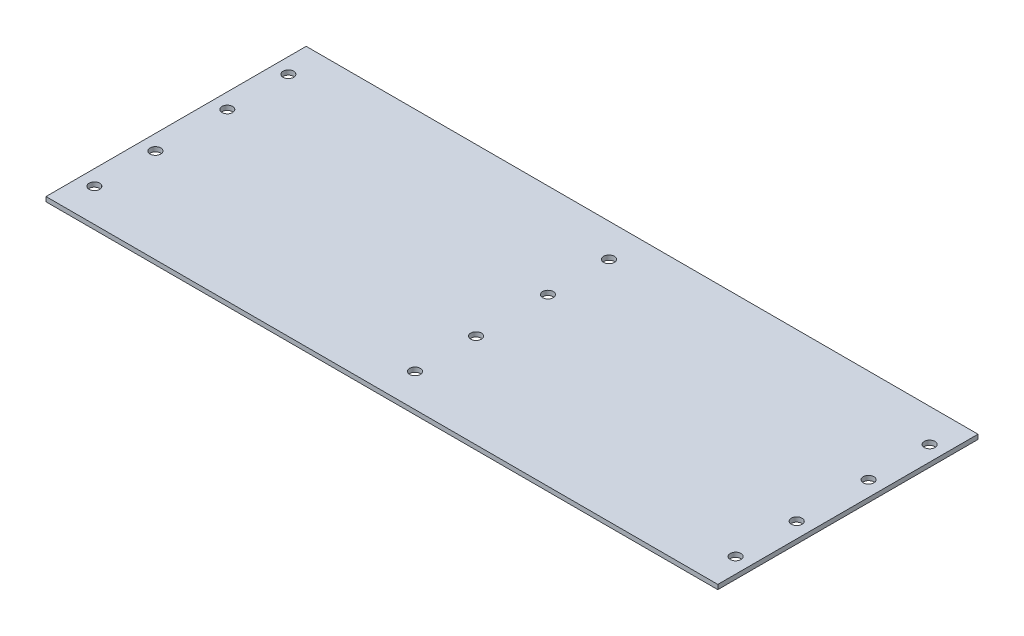
ISO-10303-21;
HEADER;
FILE_DESCRIPTION(('STEP AP214'),'2;1');
FILE_NAME('part.step','',(''),(''),'','','');
FILE_SCHEMA(('AUTOMOTIVE_DESIGN { 1 0 10303 214 1 1 1 1 }'));
ENDSEC;
DATA;
#1=APPLICATION_CONTEXT('core data for automotive mechanical design processes');
#2=APPLICATION_PROTOCOL_DEFINITION('international standard','automotive_design',2000,#1);
#3=PRODUCT_CONTEXT('',#1,'mechanical');
#4=PRODUCT('Part','Part','',(#3));
#5=PRODUCT_RELATED_PRODUCT_CATEGORY('part','',(#4));
#6=PRODUCT_DEFINITION_FORMATION('','',#4);
#7=PRODUCT_DEFINITION_CONTEXT('part definition',#1,'design');
#8=PRODUCT_DEFINITION('design','',#6,#7);
#9=PRODUCT_DEFINITION_SHAPE('','',#8);
#10=(LENGTH_UNIT() NAMED_UNIT(*) SI_UNIT(.MILLI.,.METRE.));
#11=(NAMED_UNIT(*) PLANE_ANGLE_UNIT() SI_UNIT($,.RADIAN.));
#12=(NAMED_UNIT(*) SI_UNIT($,.STERADIAN.) SOLID_ANGLE_UNIT());
#13=UNCERTAINTY_MEASURE_WITH_UNIT(LENGTH_MEASURE(1.E-05),#10,'distance_accuracy_value','');
#14=(GEOMETRIC_REPRESENTATION_CONTEXT(3) GLOBAL_UNCERTAINTY_ASSIGNED_CONTEXT((#13)) GLOBAL_UNIT_ASSIGNED_CONTEXT((#10,
#11,#12)) REPRESENTATION_CONTEXT('',''));
#15=CARTESIAN_POINT('',(0.,0.,0.));
#16=DIRECTION('',(0.,0.,1.));
#17=DIRECTION('',(1.,0.,0.));
#18=AXIS2_PLACEMENT_3D('',#15,#16,#17);
#19=CARTESIAN_POINT('',(0.,1.5,0.));
#20=DIRECTION('',(0.,1.,0.));
#21=DIRECTION('',(0.,0.,1.));
#22=AXIS2_PLACEMENT_3D('',#19,#20,#21);
#23=PLANE('',#22);
#24=CARTESIAN_POINT('',(149.295012832051,1.5,-13.4872525947132));
#25=DIRECTION('',(0.,1.,0.));
#26=DIRECTION('',(0.,0.,1.));
#27=AXIS2_PLACEMENT_3D('',#24,#25,#26);
#28=CIRCLE('',#27,1.74999999999922);
#29=CARTESIAN_POINT('',(149.295012832051,1.5,-11.737252594714));
#30=VERTEX_POINT('',#29);
#31=EDGE_CURVE('E342',#30,#30,#28,.F.);
#32=ORIENTED_EDGE('',*,*,#31,.T.);
#33=EDGE_LOOP('',(#32));
#34=FACE_BOUND('',#33,.T.);
#35=CARTESIAN_POINT('',(-60.704987167949,1.5,-33.4872525947146));
#36=DIRECTION('',(0.,1.,0.));
#37=DIRECTION('',(0.,0.,1.));
#38=AXIS2_PLACEMENT_3D('',#35,#36,#37);
#39=CIRCLE('',#38,1.74999999999922);
#40=CARTESIAN_POINT('',(-60.704987167949,1.5,-31.7372525947154));
#41=VERTEX_POINT('',#40);
#42=EDGE_CURVE('E353',#41,#41,#39,.F.);
#43=ORIENTED_EDGE('',*,*,#42,.T.);
#44=EDGE_LOOP('',(#43));
#45=FACE_BOUND('',#44,.T.);
#46=CARTESIAN_POINT('',(149.295012832051,1.5,10.0527474052838));
#47=DIRECTION('',(0.,1.,0.));
#48=DIRECTION('',(0.,0.,1.));
#49=AXIS2_PLACEMENT_3D('',#46,#47,#48);
#50=CIRCLE('',#49,1.75000000000001);
#51=CARTESIAN_POINT('',(149.295012832051,1.5,11.8027474052838));
#52=VERTEX_POINT('',#51);
#53=EDGE_CURVE('E360',#52,#52,#50,.T.);
#54=ORIENTED_EDGE('',*,*,#53,.F.);
#55=EDGE_LOOP('',(#54));
#56=FACE_BOUND('',#55,.T.);
#57=CARTESIAN_POINT('',(44.295012832051,1.5,10.0527474052845));
#58=DIRECTION('',(0.,1.,0.));
#59=DIRECTION('',(0.,0.,1.));
#60=AXIS2_PLACEMENT_3D('',#57,#58,#59);
#61=CIRCLE('',#60,1.75000000000001);
#62=CARTESIAN_POINT('',(44.295012832051,1.5,11.8027474052845));
#63=VERTEX_POINT('',#62);
#64=EDGE_CURVE('E358',#63,#63,#61,.T.);
#65=ORIENTED_EDGE('',*,*,#64,.F.);
#66=EDGE_LOOP('',(#65));
#67=FACE_BOUND('',#66,.T.);
#68=CARTESIAN_POINT('',(44.2950128320511,1.5,30.0527474052845));
#69=DIRECTION('',(0.,1.,0.));
#70=DIRECTION('',(0.,0.,1.));
#71=AXIS2_PLACEMENT_3D('',#68,#69,#70);
#72=CIRCLE('',#71,1.75000000000001);
#73=CARTESIAN_POINT('',(44.2950128320511,1.5,31.8027474052845));
#74=VERTEX_POINT('',#73);
#75=EDGE_CURVE('E347',#74,#74,#72,.T.);
#76=ORIENTED_EDGE('',*,*,#75,.F.);
#77=EDGE_LOOP('',(#76));
#78=FACE_BOUND('',#77,.T.);
#79=CARTESIAN_POINT('',(-60.7049871679491,1.5,-13.4872525947146));
#80=DIRECTION('',(0.,1.,0.));
#81=DIRECTION('',(0.,0.,1.));
#82=AXIS2_PLACEMENT_3D('',#79,#80,#81);
#83=CIRCLE('',#82,1.74999999999922);
#84=CARTESIAN_POINT('',(-60.7049871679491,1.5,-11.7372525947154));
#85=VERTEX_POINT('',#84);
#86=EDGE_CURVE('E399',#85,#85,#83,.F.);
#87=ORIENTED_EDGE('',*,*,#86,.T.);
#88=EDGE_LOOP('',(#87));
#89=FACE_BOUND('',#88,.T.);
#90=CARTESIAN_POINT('',(-60.7049871679489,1.5,10.0527474052852));
#91=DIRECTION('',(0.,1.,0.));
#92=DIRECTION('',(0.,0.,1.));
#93=AXIS2_PLACEMENT_3D('',#90,#91,#92);
#94=CIRCLE('',#93,1.75000000000001);
#95=CARTESIAN_POINT('',(-60.7049871679489,1.5,11.8027474052852));
#96=VERTEX_POINT('',#95);
#97=EDGE_CURVE('E403',#96,#96,#94,.T.);
#98=ORIENTED_EDGE('',*,*,#97,.F.);
#99=EDGE_LOOP('',(#98));
#100=FACE_BOUND('',#99,.T.);
#101=CARTESIAN_POINT('',(-60.7049871679489,1.5,30.0527474052852));
#102=DIRECTION('',(0.,1.,0.));
#103=DIRECTION('',(0.,0.,1.));
#104=AXIS2_PLACEMENT_3D('',#101,#102,#103);
#105=CIRCLE('',#104,1.75000000000001);
#106=CARTESIAN_POINT('',(-60.7049871679489,1.5,31.8027474052852));
#107=VERTEX_POINT('',#106);
#108=EDGE_CURVE('E406',#107,#107,#105,.T.);
#109=ORIENTED_EDGE('',*,*,#108,.F.);
#110=EDGE_LOOP('',(#109));
#111=FACE_BOUND('',#110,.T.);
#112=CARTESIAN_POINT('',(149.295012832051,1.5,30.0527474052838));
#113=DIRECTION('',(0.,1.,0.));
#114=DIRECTION('',(0.,0.,1.));
#115=AXIS2_PLACEMENT_3D('',#112,#113,#114);
#116=CIRCLE('',#115,1.75000000000001);
#117=CARTESIAN_POINT('',(149.295012832051,1.5,31.8027474052838));
#118=VERTEX_POINT('',#117);
#119=EDGE_CURVE('E129',#118,#118,#116,.T.);
#120=ORIENTED_EDGE('',*,*,#119,.F.);
#121=EDGE_LOOP('',(#120));
#122=FACE_BOUND('',#121,.T.);
#123=DIRECTION('',(0.,0.,1.));
#124=VECTOR('',#123,1.);
#125=CARTESIAN_POINT('',(-65.7049871679489,1.5,-44.3172525947162));
#126=LINE('',#125,#124);
#127=CARTESIAN_POINT('',(-65.7049871679489,1.5,-44.3172525947162));
#128=VERTEX_POINT('',#127);
#129=CARTESIAN_POINT('',(-65.7049871679489,1.5,40.8827474052838));
#130=VERTEX_POINT('',#129);
#131=EDGE_CURVE('E93',#128,#130,#126,.T.);
#132=ORIENTED_EDGE('',*,*,#131,.T.);
#133=DIRECTION('',(1.,0.,0.));
#134=VECTOR('',#133,1.);
#135=CARTESIAN_POINT('',(-65.7049871679489,1.5,40.8827474052838));
#136=LINE('',#135,#134);
#137=CARTESIAN_POINT('',(154.295012832051,1.5,40.8827474052838));
#138=VERTEX_POINT('',#137);
#139=EDGE_CURVE('E88',#130,#138,#136,.T.);
#140=ORIENTED_EDGE('',*,*,#139,.T.);
#141=DIRECTION('',(0.,0.,-1.));
#142=VECTOR('',#141,1.);
#143=CARTESIAN_POINT('',(154.295012832051,1.5,-44.3172525947162));
#144=LINE('',#143,#142);
#145=CARTESIAN_POINT('',(154.295012832051,1.5,-44.3172525947162));
#146=VERTEX_POINT('',#145);
#147=EDGE_CURVE('E91',#138,#146,#144,.T.);
#148=ORIENTED_EDGE('',*,*,#147,.T.);
#149=DIRECTION('',(-1.,0.,0.));
#150=VECTOR('',#149,1.);
#151=CARTESIAN_POINT('',(-65.7049871679489,1.5,-44.3172525947162));
#152=LINE('',#151,#150);
#153=EDGE_CURVE('E58',#146,#128,#152,.T.);
#154=ORIENTED_EDGE('',*,*,#153,.T.);
#155=EDGE_LOOP('',(#132,#140,#148,#154));
#156=FACE_BOUND('',#155,.T.);
#157=CARTESIAN_POINT('',(44.2950128320509,1.5,-13.4872525947139));
#158=DIRECTION('',(0.,1.,0.));
#159=DIRECTION('',(0.,0.,1.));
#160=AXIS2_PLACEMENT_3D('',#157,#158,#159);
#161=CIRCLE('',#160,1.74999999999922);
#162=CARTESIAN_POINT('',(44.2950128320509,1.5,-11.7372525947147));
#163=VERTEX_POINT('',#162);
#164=EDGE_CURVE('E341',#163,#163,#161,.F.);
#165=ORIENTED_EDGE('',*,*,#164,.T.);
#166=EDGE_LOOP('',(#165));
#167=FACE_BOUND('',#166,.T.);
#168=CARTESIAN_POINT('',(149.295012832051,1.5,-33.4872525947132));
#169=DIRECTION('',(0.,1.,0.));
#170=DIRECTION('',(0.,0.,1.));
#171=AXIS2_PLACEMENT_3D('',#168,#169,#170);
#172=CIRCLE('',#171,1.74999999999922);
#173=CARTESIAN_POINT('',(149.295012832051,1.5,-31.737252594714));
#174=VERTEX_POINT('',#173);
#175=EDGE_CURVE('E350',#174,#174,#172,.F.);
#176=ORIENTED_EDGE('',*,*,#175,.T.);
#177=EDGE_LOOP('',(#176));
#178=FACE_BOUND('',#177,.T.);
#179=CARTESIAN_POINT('',(44.295012832051,1.5,-33.4872525947139));
#180=DIRECTION('',(0.,1.,0.));
#181=DIRECTION('',(0.,0.,1.));
#182=AXIS2_PLACEMENT_3D('',#179,#180,#181);
#183=CIRCLE('',#182,1.74999999999922);
#184=CARTESIAN_POINT('',(44.295012832051,1.5,-31.7372525947147));
#185=VERTEX_POINT('',#184);
#186=EDGE_CURVE('E338',#185,#185,#183,.F.);
#187=ORIENTED_EDGE('',*,*,#186,.T.);
#188=EDGE_LOOP('',(#187));
#189=FACE_BOUND('',#188,.T.);
#190=ADVANCED_FACE('F38',(#34,#45,#56,#67,#78,#89,#100,#111,#122,#156,#167,#178,#189),#23,.T.);
#191=CARTESIAN_POINT('',(0.,0.,0.));
#192=DIRECTION('',(0.,1.,0.));
#193=DIRECTION('',(0.,0.,1.));
#194=AXIS2_PLACEMENT_3D('',#191,#192,#193);
#195=PLANE('',#194);
#196=CARTESIAN_POINT('',(149.295012832051,0.,10.0527474052838));
#197=DIRECTION('',(0.,1.,0.));
#198=DIRECTION('',(0.,0.,1.));
#199=AXIS2_PLACEMENT_3D('',#196,#197,#198);
#200=CIRCLE('',#199,1.75000000000001);
#201=CARTESIAN_POINT('',(149.295012832051,0.,11.8027474052838));
#202=VERTEX_POINT('',#201);
#203=EDGE_CURVE('E153',#202,#202,#200,.T.);
#204=ORIENTED_EDGE('',*,*,#203,.T.);
#205=EDGE_LOOP('',(#204));
#206=FACE_BOUND('',#205,.T.);
#207=CARTESIAN_POINT('',(44.295012832051,0.,10.0527474052845));
#208=DIRECTION('',(0.,1.,0.));
#209=DIRECTION('',(0.,0.,1.));
#210=AXIS2_PLACEMENT_3D('',#207,#208,#209);
#211=CIRCLE('',#210,1.75000000000001);
#212=CARTESIAN_POINT('',(44.295012832051,0.,11.8027474052845));
#213=VERTEX_POINT('',#212);
#214=EDGE_CURVE('E149',#213,#213,#211,.T.);
#215=ORIENTED_EDGE('',*,*,#214,.T.);
#216=EDGE_LOOP('',(#215));
#217=FACE_BOUND('',#216,.T.);
#218=CARTESIAN_POINT('',(44.2950128320511,0.,30.0527474052845));
#219=DIRECTION('',(0.,1.,0.));
#220=DIRECTION('',(0.,0.,1.));
#221=AXIS2_PLACEMENT_3D('',#218,#219,#220);
#222=CIRCLE('',#221,1.75000000000001);
#223=CARTESIAN_POINT('',(44.2950128320511,0.,31.8027474052845));
#224=VERTEX_POINT('',#223);
#225=EDGE_CURVE('E145',#224,#224,#222,.T.);
#226=ORIENTED_EDGE('',*,*,#225,.T.);
#227=EDGE_LOOP('',(#226));
#228=FACE_BOUND('',#227,.T.);
#229=CARTESIAN_POINT('',(-60.7049871679489,0.,10.0527474052852));
#230=DIRECTION('',(0.,1.,0.));
#231=DIRECTION('',(0.,0.,1.));
#232=AXIS2_PLACEMENT_3D('',#229,#230,#231);
#233=CIRCLE('',#232,1.75000000000001);
#234=CARTESIAN_POINT('',(-60.7049871679489,0.,11.8027474052852));
#235=VERTEX_POINT('',#234);
#236=EDGE_CURVE('E133',#235,#235,#233,.T.);
#237=ORIENTED_EDGE('',*,*,#236,.T.);
#238=EDGE_LOOP('',(#237));
#239=FACE_BOUND('',#238,.T.);
#240=CARTESIAN_POINT('',(-60.7049871679489,0.,30.0527474052852));
#241=DIRECTION('',(0.,1.,0.));
#242=DIRECTION('',(0.,0.,1.));
#243=AXIS2_PLACEMENT_3D('',#240,#241,#242);
#244=CIRCLE('',#243,1.75000000000001);
#245=CARTESIAN_POINT('',(-60.7049871679489,0.,31.8027474052852));
#246=VERTEX_POINT('',#245);
#247=EDGE_CURVE('E128',#246,#246,#244,.T.);
#248=ORIENTED_EDGE('',*,*,#247,.T.);
#249=EDGE_LOOP('',(#248));
#250=FACE_BOUND('',#249,.T.);
#251=CARTESIAN_POINT('',(149.295012832051,0.,30.0527474052838));
#252=DIRECTION('',(0.,1.,0.));
#253=DIRECTION('',(0.,0.,1.));
#254=AXIS2_PLACEMENT_3D('',#251,#252,#253);
#255=CIRCLE('',#254,1.75000000000001);
#256=CARTESIAN_POINT('',(149.295012832051,0.,31.8027474052838));
#257=VERTEX_POINT('',#256);
#258=EDGE_CURVE('E124',#257,#257,#255,.T.);
#259=ORIENTED_EDGE('',*,*,#258,.T.);
#260=EDGE_LOOP('',(#259));
#261=FACE_BOUND('',#260,.T.);
#262=DIRECTION('',(0.,0.,1.));
#263=VECTOR('',#262,1.);
#264=CARTESIAN_POINT('',(-65.7049871679489,0.,-44.3172525947162));
#265=LINE('',#264,#263);
#266=CARTESIAN_POINT('',(-65.7049871679489,0.,-44.3172525947162));
#267=VERTEX_POINT('',#266);
#268=CARTESIAN_POINT('',(-65.7049871679489,0.,40.8827474052838));
#269=VERTEX_POINT('',#268);
#270=EDGE_CURVE('E110',#267,#269,#265,.T.);
#271=ORIENTED_EDGE('',*,*,#270,.F.);
#272=DIRECTION('',(-1.,0.,0.));
#273=VECTOR('',#272,1.);
#274=CARTESIAN_POINT('',(-65.7049871679489,0.,-44.3172525947162));
#275=LINE('',#274,#273);
#276=CARTESIAN_POINT('',(154.295012832051,0.,-44.3172525947162));
#277=VERTEX_POINT('',#276);
#278=EDGE_CURVE('E81',#277,#267,#275,.T.);
#279=ORIENTED_EDGE('',*,*,#278,.F.);
#280=DIRECTION('',(0.,0.,-1.));
#281=VECTOR('',#280,1.);
#282=CARTESIAN_POINT('',(154.295012832051,0.,-44.3172525947162));
#283=LINE('',#282,#281);
#284=CARTESIAN_POINT('',(154.295012832051,0.,40.8827474052838));
#285=VERTEX_POINT('',#284);
#286=EDGE_CURVE('E75',#285,#277,#283,.T.);
#287=ORIENTED_EDGE('',*,*,#286,.F.);
#288=DIRECTION('',(1.,0.,0.));
#289=VECTOR('',#288,1.);
#290=CARTESIAN_POINT('',(-65.7049871679489,0.,40.8827474052838));
#291=LINE('',#290,#289);
#292=EDGE_CURVE('E98',#269,#285,#291,.T.);
#293=ORIENTED_EDGE('',*,*,#292,.F.);
#294=EDGE_LOOP('',(#271,#279,#287,#293));
#295=FACE_BOUND('',#294,.T.);
#296=CARTESIAN_POINT('',(-60.7049871679491,0.,-13.4872525947146));
#297=DIRECTION('',(0.,1.,0.));
#298=DIRECTION('',(0.,0.,1.));
#299=AXIS2_PLACEMENT_3D('',#296,#297,#298);
#300=CIRCLE('',#299,1.74999999999922);
#301=CARTESIAN_POINT('',(-60.7049871679491,0.,-11.7372525947154));
#302=VERTEX_POINT('',#301);
#303=EDGE_CURVE('E137',#302,#302,#300,.F.);
#304=ORIENTED_EDGE('',*,*,#303,.F.);
#305=EDGE_LOOP('',(#304));
#306=FACE_BOUND('',#305,.T.);
#307=CARTESIAN_POINT('',(44.2950128320509,0.,-13.4872525947139));
#308=DIRECTION('',(0.,1.,0.));
#309=DIRECTION('',(0.,0.,1.));
#310=AXIS2_PLACEMENT_3D('',#307,#308,#309);
#311=CIRCLE('',#310,1.74999999999922);
#312=CARTESIAN_POINT('',(44.2950128320509,0.,-11.7372525947147));
#313=VERTEX_POINT('',#312);
#314=EDGE_CURVE('E141',#313,#313,#311,.F.);
#315=ORIENTED_EDGE('',*,*,#314,.F.);
#316=EDGE_LOOP('',(#315));
#317=FACE_BOUND('',#316,.T.);
#318=CARTESIAN_POINT('',(-60.704987167949,0.,-33.4872525947146));
#319=DIRECTION('',(0.,1.,0.));
#320=DIRECTION('',(0.,0.,1.));
#321=AXIS2_PLACEMENT_3D('',#318,#319,#320);
#322=CIRCLE('',#321,1.74999999999922);
#323=CARTESIAN_POINT('',(-60.704987167949,0.,-31.7372525947154));
#324=VERTEX_POINT('',#323);
#325=EDGE_CURVE('E157',#324,#324,#322,.F.);
#326=ORIENTED_EDGE('',*,*,#325,.F.);
#327=EDGE_LOOP('',(#326));
#328=FACE_BOUND('',#327,.T.);
#329=CARTESIAN_POINT('',(149.295012832051,0.,-33.4872525947132));
#330=DIRECTION('',(0.,1.,0.));
#331=DIRECTION('',(0.,0.,1.));
#332=AXIS2_PLACEMENT_3D('',#329,#330,#331);
#333=CIRCLE('',#332,1.74999999999922);
#334=CARTESIAN_POINT('',(149.295012832051,0.,-31.737252594714));
#335=VERTEX_POINT('',#334);
#336=EDGE_CURVE('E161',#335,#335,#333,.F.);
#337=ORIENTED_EDGE('',*,*,#336,.F.);
#338=EDGE_LOOP('',(#337));
#339=FACE_BOUND('',#338,.T.);
#340=CARTESIAN_POINT('',(149.295012832051,0.,-13.4872525947132));
#341=DIRECTION('',(0.,1.,0.));
#342=DIRECTION('',(0.,0.,1.));
#343=AXIS2_PLACEMENT_3D('',#340,#341,#342);
#344=CIRCLE('',#343,1.74999999999922);
#345=CARTESIAN_POINT('',(149.295012832051,0.,-11.737252594714));
#346=VERTEX_POINT('',#345);
#347=EDGE_CURVE('E164',#346,#346,#344,.F.);
#348=ORIENTED_EDGE('',*,*,#347,.F.);
#349=EDGE_LOOP('',(#348));
#350=FACE_BOUND('',#349,.T.);
#351=CARTESIAN_POINT('',(44.295012832051,0.,-33.4872525947139));
#352=DIRECTION('',(0.,1.,0.));
#353=DIRECTION('',(0.,0.,1.));
#354=AXIS2_PLACEMENT_3D('',#351,#352,#353);
#355=CIRCLE('',#354,1.74999999999922);
#356=CARTESIAN_POINT('',(44.295012832051,0.,-31.7372525947147));
#357=VERTEX_POINT('',#356);
#358=EDGE_CURVE('E42',#357,#357,#355,.F.);
#359=ORIENTED_EDGE('',*,*,#358,.F.);
#360=EDGE_LOOP('',(#359));
#361=FACE_BOUND('',#360,.T.);
#362=ADVANCED_FACE('F175',(#206,#217,#228,#239,#250,#261,#295,#306,#317,#328,#339,#350,#361),
#195,.F.);
#363=CARTESIAN_POINT('',(-65.7049871679489,1.5,-44.3172525947162));
#364=DIRECTION('',(1.,0.,0.));
#365=DIRECTION('',(0.,0.,-1.));
#366=AXIS2_PLACEMENT_3D('',#363,#364,#365);
#367=PLANE('',#366);
#368=ORIENTED_EDGE('',*,*,#270,.T.);
#369=DIRECTION('',(0.,-1.,0.));
#370=VECTOR('',#369,1.);
#371=CARTESIAN_POINT('',(-65.7049871679489,1.5,40.8827474052838));
#372=LINE('',#371,#370);
#373=EDGE_CURVE('E11',#130,#269,#372,.T.);
#374=ORIENTED_EDGE('',*,*,#373,.F.);
#375=ORIENTED_EDGE('',*,*,#131,.F.);
#376=DIRECTION('',(0.,-1.,0.));
#377=VECTOR('',#376,1.);
#378=CARTESIAN_POINT('',(-65.7049871679489,1.5,-44.3172525947162));
#379=LINE('',#378,#377);
#380=EDGE_CURVE('E106',#128,#267,#379,.T.);
#381=ORIENTED_EDGE('',*,*,#380,.T.);
#382=EDGE_LOOP('',(#368,#374,#375,#381));
#383=FACE_BOUND('',#382,.T.);
#384=ADVANCED_FACE('F40',(#383),#367,.F.);
#385=CARTESIAN_POINT('',(-65.7049871679489,1.5,40.8827474052838));
#386=DIRECTION('',(0.,0.,-1.));
#387=DIRECTION('',(-1.,0.,0.));
#388=AXIS2_PLACEMENT_3D('',#385,#386,#387);
#389=PLANE('',#388);
#390=ORIENTED_EDGE('',*,*,#292,.T.);
#391=DIRECTION('',(0.,-1.,0.));
#392=VECTOR('',#391,1.);
#393=CARTESIAN_POINT('',(154.295012832051,1.5,40.8827474052838));
#394=LINE('',#393,#392);
#395=EDGE_CURVE('E49',#138,#285,#394,.T.);
#396=ORIENTED_EDGE('',*,*,#395,.F.);
#397=ORIENTED_EDGE('',*,*,#139,.F.);
#398=ORIENTED_EDGE('',*,*,#373,.T.);
#399=EDGE_LOOP('',(#390,#396,#397,#398));
#400=FACE_BOUND('',#399,.T.);
#401=ADVANCED_FACE('F97',(#400),#389,.F.);
#402=CARTESIAN_POINT('',(154.295012832051,1.5,-44.3172525947162));
#403=DIRECTION('',(-1.,0.,0.));
#404=DIRECTION('',(0.,0.,1.));
#405=AXIS2_PLACEMENT_3D('',#402,#403,#404);
#406=PLANE('',#405);
#407=ORIENTED_EDGE('',*,*,#286,.T.);
#408=DIRECTION('',(0.,-1.,0.));
#409=VECTOR('',#408,1.);
#410=CARTESIAN_POINT('',(154.295012832051,1.5,-44.3172525947162));
#411=LINE('',#410,#409);
#412=EDGE_CURVE('E100',#146,#277,#411,.T.);
#413=ORIENTED_EDGE('',*,*,#412,.F.);
#414=ORIENTED_EDGE('',*,*,#147,.F.);
#415=ORIENTED_EDGE('',*,*,#395,.T.);
#416=EDGE_LOOP('',(#407,#413,#414,#415));
#417=FACE_BOUND('',#416,.T.);
#418=ADVANCED_FACE('F102',(#417),#406,.F.);
#419=CARTESIAN_POINT('',(-65.7049871679489,1.5,-44.3172525947162));
#420=DIRECTION('',(0.,0.,1.));
#421=DIRECTION('',(1.,0.,0.));
#422=AXIS2_PLACEMENT_3D('',#419,#420,#421);
#423=PLANE('',#422);
#424=ORIENTED_EDGE('',*,*,#278,.T.);
#425=ORIENTED_EDGE('',*,*,#380,.F.);
#426=ORIENTED_EDGE('',*,*,#153,.F.);
#427=ORIENTED_EDGE('',*,*,#412,.T.);
#428=EDGE_LOOP('',(#424,#425,#426,#427));
#429=FACE_BOUND('',#428,.T.);
#430=ADVANCED_FACE('F190',(#429),#423,.F.);
#431=CARTESIAN_POINT('',(149.295012832051,-8.5,30.0527474052838));
#432=DIRECTION('',(0.,1.,0.));
#433=DIRECTION('',(0.,0.,1.));
#434=AXIS2_PLACEMENT_3D('',#431,#432,#433);
#435=CYLINDRICAL_SURFACE('',#434,1.75000000000001);
#436=ORIENTED_EDGE('',*,*,#119,.T.);
#437=EDGE_LOOP('',(#436));
#438=FACE_BOUND('',#437,.T.);
#439=ORIENTED_EDGE('',*,*,#258,.F.);
#440=EDGE_LOOP('',(#439));
#441=FACE_BOUND('',#440,.T.);
#442=ADVANCED_FACE('F193',(#438,#441),#435,.F.);
#443=CARTESIAN_POINT('',(-60.7049871679489,-8.5,30.0527474052852));
#444=DIRECTION('',(0.,1.,0.));
#445=DIRECTION('',(0.,0.,1.));
#446=AXIS2_PLACEMENT_3D('',#443,#444,#445);
#447=CYLINDRICAL_SURFACE('',#446,1.75000000000001);
#448=ORIENTED_EDGE('',*,*,#108,.T.);
#449=EDGE_LOOP('',(#448));
#450=FACE_BOUND('',#449,.T.);
#451=ORIENTED_EDGE('',*,*,#247,.F.);
#452=EDGE_LOOP('',(#451));
#453=FACE_BOUND('',#452,.T.);
#454=ADVANCED_FACE('F224',(#450,#453),#447,.F.);
#455=CARTESIAN_POINT('',(-60.7049871679489,-8.5,10.0527474052852));
#456=DIRECTION('',(0.,1.,0.));
#457=DIRECTION('',(0.,0.,1.));
#458=AXIS2_PLACEMENT_3D('',#455,#456,#457);
#459=CYLINDRICAL_SURFACE('',#458,1.75000000000001);
#460=ORIENTED_EDGE('',*,*,#97,.T.);
#461=EDGE_LOOP('',(#460));
#462=FACE_BOUND('',#461,.T.);
#463=ORIENTED_EDGE('',*,*,#236,.F.);
#464=EDGE_LOOP('',(#463));
#465=FACE_BOUND('',#464,.T.);
#466=ADVANCED_FACE('F230',(#462,#465),#459,.F.);
#467=CARTESIAN_POINT('',(-60.7049871679491,-8.5,-13.4872525947146));
#468=DIRECTION('',(0.,1.,0.));
#469=DIRECTION('',(0.,0.,1.));
#470=AXIS2_PLACEMENT_3D('',#467,#468,#469);
#471=CYLINDRICAL_SURFACE('',#470,1.74999999999922);
#472=ORIENTED_EDGE('',*,*,#86,.F.);
#473=EDGE_LOOP('',(#472));
#474=FACE_BOUND('',#473,.T.);
#475=ORIENTED_EDGE('',*,*,#303,.T.);
#476=EDGE_LOOP('',(#475));
#477=FACE_BOUND('',#476,.T.);
#478=ADVANCED_FACE('F238',(#474,#477),#471,.F.);
#479=CARTESIAN_POINT('',(44.2950128320509,-8.5,-13.4872525947139));
#480=DIRECTION('',(0.,1.,0.));
#481=DIRECTION('',(0.,0.,1.));
#482=AXIS2_PLACEMENT_3D('',#479,#480,#481);
#483=CYLINDRICAL_SURFACE('',#482,1.74999999999922);
#484=ORIENTED_EDGE('',*,*,#164,.F.);
#485=EDGE_LOOP('',(#484));
#486=FACE_BOUND('',#485,.T.);
#487=ORIENTED_EDGE('',*,*,#314,.T.);
#488=EDGE_LOOP('',(#487));
#489=FACE_BOUND('',#488,.T.);
#490=ADVANCED_FACE('F246',(#486,#489),#483,.F.);
#491=CARTESIAN_POINT('',(44.2950128320511,-8.5,30.0527474052845));
#492=DIRECTION('',(0.,1.,0.));
#493=DIRECTION('',(0.,0.,1.));
#494=AXIS2_PLACEMENT_3D('',#491,#492,#493);
#495=CYLINDRICAL_SURFACE('',#494,1.75000000000001);
#496=ORIENTED_EDGE('',*,*,#75,.T.);
#497=EDGE_LOOP('',(#496));
#498=FACE_BOUND('',#497,.T.);
#499=ORIENTED_EDGE('',*,*,#225,.F.);
#500=EDGE_LOOP('',(#499));
#501=FACE_BOUND('',#500,.T.);
#502=ADVANCED_FACE('F254',(#498,#501),#495,.F.);
#503=CARTESIAN_POINT('',(44.295012832051,-8.5,10.0527474052845));
#504=DIRECTION('',(0.,1.,0.));
#505=DIRECTION('',(0.,0.,1.));
#506=AXIS2_PLACEMENT_3D('',#503,#504,#505);
#507=CYLINDRICAL_SURFACE('',#506,1.75000000000001);
#508=ORIENTED_EDGE('',*,*,#64,.T.);
#509=EDGE_LOOP('',(#508));
#510=FACE_BOUND('',#509,.T.);
#511=ORIENTED_EDGE('',*,*,#214,.F.);
#512=EDGE_LOOP('',(#511));
#513=FACE_BOUND('',#512,.T.);
#514=ADVANCED_FACE('F262',(#510,#513),#507,.F.);
#515=CARTESIAN_POINT('',(149.295012832051,-8.5,10.0527474052838));
#516=DIRECTION('',(0.,1.,0.));
#517=DIRECTION('',(0.,0.,1.));
#518=AXIS2_PLACEMENT_3D('',#515,#516,#517);
#519=CYLINDRICAL_SURFACE('',#518,1.75000000000001);
#520=ORIENTED_EDGE('',*,*,#53,.T.);
#521=EDGE_LOOP('',(#520));
#522=FACE_BOUND('',#521,.T.);
#523=ORIENTED_EDGE('',*,*,#203,.F.);
#524=EDGE_LOOP('',(#523));
#525=FACE_BOUND('',#524,.T.);
#526=ADVANCED_FACE('F270',(#522,#525),#519,.F.);
#527=CARTESIAN_POINT('',(-60.704987167949,-8.5,-33.4872525947146));
#528=DIRECTION('',(0.,1.,0.));
#529=DIRECTION('',(0.,0.,1.));
#530=AXIS2_PLACEMENT_3D('',#527,#528,#529);
#531=CYLINDRICAL_SURFACE('',#530,1.74999999999922);
#532=ORIENTED_EDGE('',*,*,#42,.F.);
#533=EDGE_LOOP('',(#532));
#534=FACE_BOUND('',#533,.T.);
#535=ORIENTED_EDGE('',*,*,#325,.T.);
#536=EDGE_LOOP('',(#535));
#537=FACE_BOUND('',#536,.T.);
#538=ADVANCED_FACE('F278',(#534,#537),#531,.F.);
#539=CARTESIAN_POINT('',(149.295012832051,-8.5,-33.4872525947132));
#540=DIRECTION('',(0.,1.,0.));
#541=DIRECTION('',(0.,0.,1.));
#542=AXIS2_PLACEMENT_3D('',#539,#540,#541);
#543=CYLINDRICAL_SURFACE('',#542,1.74999999999922);
#544=ORIENTED_EDGE('',*,*,#175,.F.);
#545=EDGE_LOOP('',(#544));
#546=FACE_BOUND('',#545,.T.);
#547=ORIENTED_EDGE('',*,*,#336,.T.);
#548=EDGE_LOOP('',(#547));
#549=FACE_BOUND('',#548,.T.);
#550=ADVANCED_FACE('F286',(#546,#549),#543,.F.);
#551=CARTESIAN_POINT('',(149.295012832051,-8.5,-13.4872525947132));
#552=DIRECTION('',(0.,1.,0.));
#553=DIRECTION('',(0.,0.,1.));
#554=AXIS2_PLACEMENT_3D('',#551,#552,#553);
#555=CYLINDRICAL_SURFACE('',#554,1.74999999999922);
#556=ORIENTED_EDGE('',*,*,#31,.F.);
#557=EDGE_LOOP('',(#556));
#558=FACE_BOUND('',#557,.T.);
#559=ORIENTED_EDGE('',*,*,#347,.T.);
#560=EDGE_LOOP('',(#559));
#561=FACE_BOUND('',#560,.T.);
#562=ADVANCED_FACE('F294',(#558,#561),#555,.F.);
#563=CARTESIAN_POINT('',(44.295012832051,-8.5,-33.4872525947139));
#564=DIRECTION('',(0.,1.,0.));
#565=DIRECTION('',(0.,0.,1.));
#566=AXIS2_PLACEMENT_3D('',#563,#564,#565);
#567=CYLINDRICAL_SURFACE('',#566,1.74999999999922);
#568=ORIENTED_EDGE('',*,*,#186,.F.);
#569=EDGE_LOOP('',(#568));
#570=FACE_BOUND('',#569,.T.);
#571=ORIENTED_EDGE('',*,*,#358,.T.);
#572=EDGE_LOOP('',(#571));
#573=FACE_BOUND('',#572,.T.);
#574=ADVANCED_FACE('F173',(#570,#573),#567,.F.);
#575=CLOSED_SHELL('',(#190,#362,#384,#401,#418,#430,#442,#454,#466,#478,#490,#502,#514,#526,
#538,#550,#562,#574));
#576=MANIFOLD_SOLID_BREP('B2',#575);
#577=ADVANCED_BREP_SHAPE_REPRESENTATION('',(#18,#576),#14);
#578=SHAPE_DEFINITION_REPRESENTATION(#9,#577);
ENDSEC;
END-ISO-10303-21;
